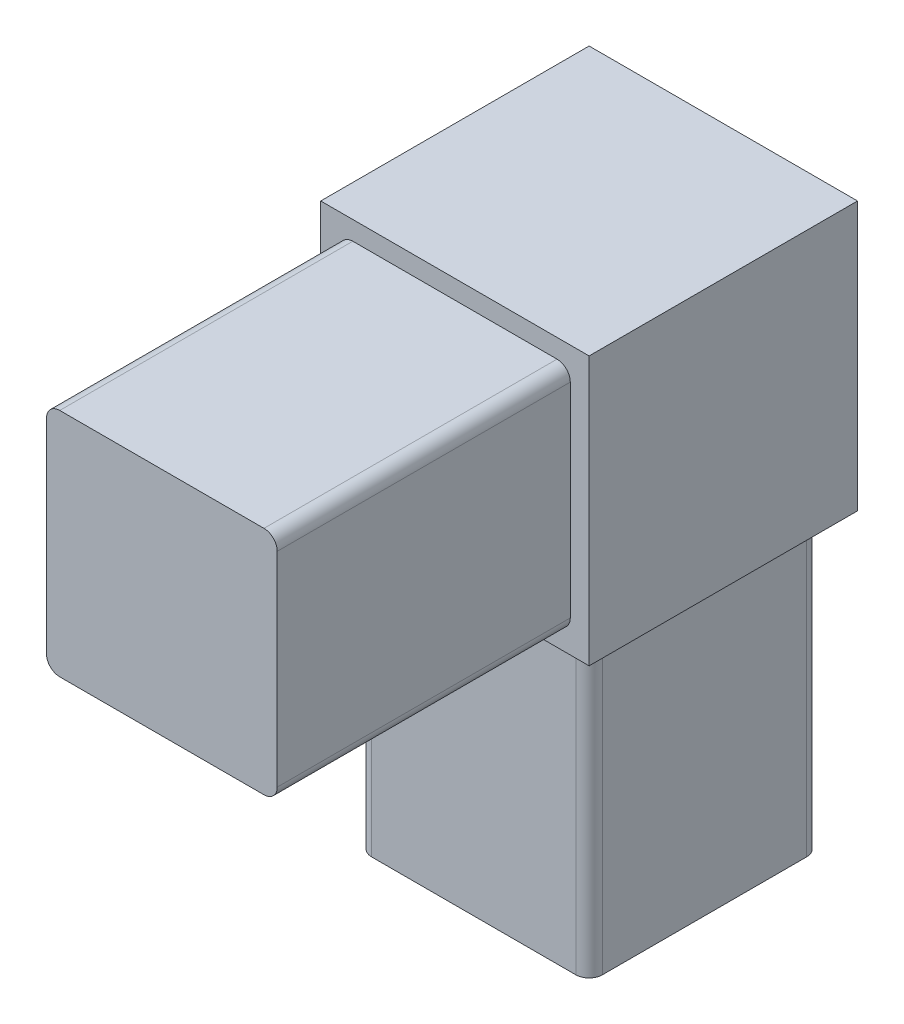
ISO-10303-21;
HEADER;
FILE_DESCRIPTION(('STEP AP214'),'2;1');
FILE_NAME('part.step','',(''),(''),'','','');
FILE_SCHEMA(('AUTOMOTIVE_DESIGN { 1 0 10303 214 1 1 1 1 }'));
ENDSEC;
DATA;
#1=APPLICATION_CONTEXT('core data for automotive mechanical design processes');
#2=APPLICATION_PROTOCOL_DEFINITION('international standard','automotive_design',2000,#1);
#3=PRODUCT_CONTEXT('',#1,'mechanical');
#4=PRODUCT('Part','Part','',(#3));
#5=PRODUCT_RELATED_PRODUCT_CATEGORY('part','',(#4));
#6=PRODUCT_DEFINITION_FORMATION('','',#4);
#7=PRODUCT_DEFINITION_CONTEXT('part definition',#1,'design');
#8=PRODUCT_DEFINITION('design','',#6,#7);
#9=PRODUCT_DEFINITION_SHAPE('','',#8);
#10=(LENGTH_UNIT() NAMED_UNIT(*) SI_UNIT(.MILLI.,.METRE.));
#11=(NAMED_UNIT(*) PLANE_ANGLE_UNIT() SI_UNIT($,.RADIAN.));
#12=(NAMED_UNIT(*) SI_UNIT($,.STERADIAN.) SOLID_ANGLE_UNIT());
#13=UNCERTAINTY_MEASURE_WITH_UNIT(LENGTH_MEASURE(1.E-05),#10,'distance_accuracy_value','');
#14=(GEOMETRIC_REPRESENTATION_CONTEXT(3) GLOBAL_UNCERTAINTY_ASSIGNED_CONTEXT((#13)) GLOBAL_UNIT_ASSIGNED_CONTEXT((#10,
#11,#12)) REPRESENTATION_CONTEXT('',''));
#15=CARTESIAN_POINT('',(0.,0.,0.));
#16=DIRECTION('',(0.,0.,1.));
#17=DIRECTION('',(1.,0.,0.));
#18=AXIS2_PLACEMENT_3D('',#15,#16,#17);
#19=CARTESIAN_POINT('',(-12.8524,53.7718,12.8524));
#20=DIRECTION('',(0.,0.,-1.));
#21=DIRECTION('',(-1.,0.,0.));
#22=AXIS2_PLACEMENT_3D('',#19,#20,#21);
#23=PLANE('',#22);
#24=DIRECTION('',(1.,0.,0.));
#25=VECTOR('',#24,1.);
#26=CARTESIAN_POINT('',(-12.8524,28.067,12.8524));
#27=LINE('',#26,#25);
#28=CARTESIAN_POINT('',(-12.8524,28.067,12.8524));
#29=VERTEX_POINT('',#28);
#30=CARTESIAN_POINT('',(12.8524,28.067,12.8524));
#31=VERTEX_POINT('',#30);
#32=EDGE_CURVE('E191',#29,#31,#27,.T.);
#33=ORIENTED_EDGE('',*,*,#32,.T.);
#34=DIRECTION('',(0.,-1.,0.));
#35=VECTOR('',#34,1.);
#36=CARTESIAN_POINT('',(12.8524,53.7718,12.8524));
#37=LINE('',#36,#35);
#38=CARTESIAN_POINT('',(12.8524,53.7718,12.8524));
#39=VERTEX_POINT('',#38);
#40=EDGE_CURVE('E411',#39,#31,#37,.T.);
#41=ORIENTED_EDGE('',*,*,#40,.F.);
#42=DIRECTION('',(1.,0.,0.));
#43=VECTOR('',#42,1.);
#44=CARTESIAN_POINT('',(-12.8524,53.7718,12.8524));
#45=LINE('',#44,#43);
#46=CARTESIAN_POINT('',(-12.8524,53.7718,12.8524));
#47=VERTEX_POINT('',#46);
#48=EDGE_CURVE('E187',#47,#39,#45,.T.);
#49=ORIENTED_EDGE('',*,*,#48,.F.);
#50=DIRECTION('',(0.,-1.,0.));
#51=VECTOR('',#50,1.);
#52=CARTESIAN_POINT('',(-12.8524,53.7718,12.8524));
#53=LINE('',#52,#51);
#54=EDGE_CURVE('E201',#47,#29,#53,.T.);
#55=ORIENTED_EDGE('',*,*,#54,.T.);
#56=EDGE_LOOP('',(#33,#41,#49,#55));
#57=FACE_BOUND('',#56,.T.);
#58=DIRECTION('',(0.,1.,0.));
#59=VECTOR('',#58,1.);
#60=CARTESIAN_POINT('',(11.049,29.8704,12.8524));
#61=LINE('',#60,#59);
#62=CARTESIAN_POINT('',(11.049,31.1404,12.8524));
#63=VERTEX_POINT('',#62);
#64=CARTESIAN_POINT('',(11.049,50.6984,12.8524));
#65=VERTEX_POINT('',#64);
#66=EDGE_CURVE('E398',#63,#65,#61,.T.);
#67=ORIENTED_EDGE('',*,*,#66,.F.);
#68=CARTESIAN_POINT('',(9.779,31.1404,12.8524));
#69=DIRECTION('',(0.,0.,-1.));
#70=DIRECTION('',(-1.,0.,0.));
#71=AXIS2_PLACEMENT_3D('',#68,#69,#70);
#72=CIRCLE('',#71,1.27);
#73=CARTESIAN_POINT('',(9.779,29.8704,12.8524));
#74=VERTEX_POINT('',#73);
#75=EDGE_CURVE('E279',#63,#74,#72,.T.);
#76=ORIENTED_EDGE('',*,*,#75,.T.);
#77=DIRECTION('',(1.,0.,0.));
#78=VECTOR('',#77,1.);
#79=CARTESIAN_POINT('',(-11.049,29.8704,12.8524));
#80=LINE('',#79,#78);
#81=CARTESIAN_POINT('',(-9.779,29.8704,12.8524));
#82=VERTEX_POINT('',#81);
#83=EDGE_CURVE('E406',#82,#74,#80,.T.);
#84=ORIENTED_EDGE('',*,*,#83,.F.);
#85=CARTESIAN_POINT('',(-9.779,31.1404,12.8524));
#86=DIRECTION('',(0.,0.,-1.));
#87=DIRECTION('',(-1.,0.,0.));
#88=AXIS2_PLACEMENT_3D('',#85,#86,#87);
#89=CIRCLE('',#88,1.27);
#90=CARTESIAN_POINT('',(-11.049,31.1404,12.8524));
#91=VERTEX_POINT('',#90);
#92=EDGE_CURVE('E283',#82,#91,#89,.T.);
#93=ORIENTED_EDGE('',*,*,#92,.T.);
#94=DIRECTION('',(0.,-1.,0.));
#95=VECTOR('',#94,1.);
#96=CARTESIAN_POINT('',(-11.049,29.8704,12.8524));
#97=LINE('',#96,#95);
#98=CARTESIAN_POINT('',(-11.049,50.6984,12.8524));
#99=VERTEX_POINT('',#98);
#100=EDGE_CURVE('E404',#99,#91,#97,.T.);
#101=ORIENTED_EDGE('',*,*,#100,.F.);
#102=CARTESIAN_POINT('',(-9.779,50.6984,12.8524));
#103=DIRECTION('',(0.,0.,-1.));
#104=DIRECTION('',(-1.,0.,0.));
#105=AXIS2_PLACEMENT_3D('',#102,#103,#104);
#106=CIRCLE('',#105,1.27);
#107=CARTESIAN_POINT('',(-9.779,51.9684,12.8524));
#108=VERTEX_POINT('',#107);
#109=EDGE_CURVE('E281',#99,#108,#106,.T.);
#110=ORIENTED_EDGE('',*,*,#109,.T.);
#111=DIRECTION('',(-1.,0.,0.));
#112=VECTOR('',#111,1.);
#113=CARTESIAN_POINT('',(-11.049,51.9684,12.8524));
#114=LINE('',#113,#112);
#115=CARTESIAN_POINT('',(9.779,51.9684,12.8524));
#116=VERTEX_POINT('',#115);
#117=EDGE_CURVE('E401',#116,#108,#114,.T.);
#118=ORIENTED_EDGE('',*,*,#117,.F.);
#119=CARTESIAN_POINT('',(9.779,50.6984,12.8524));
#120=DIRECTION('',(0.,0.,-1.));
#121=DIRECTION('',(-1.,0.,0.));
#122=AXIS2_PLACEMENT_3D('',#119,#120,#121);
#123=CIRCLE('',#122,1.27);
#124=EDGE_CURVE('E277',#116,#65,#123,.T.);
#125=ORIENTED_EDGE('',*,*,#124,.T.);
#126=EDGE_LOOP('',(#67,#76,#84,#93,#101,#110,#118,#125));
#127=FACE_BOUND('',#126,.T.);
#128=ADVANCED_FACE('F34',(#57,#127),#23,.F.);
#129=CARTESIAN_POINT('',(11.049,28.067,-11.049));
#130=DIRECTION('',(-1.,0.,0.));
#131=DIRECTION('',(0.,0.,1.));
#132=AXIS2_PLACEMENT_3D('',#129,#130,#131);
#133=PLANE('',#132);
#134=DIRECTION('',(0.,0.,-1.));
#135=VECTOR('',#134,1.);
#136=CARTESIAN_POINT('',(11.049,28.067,-11.049));
#137=LINE('',#136,#135);
#138=CARTESIAN_POINT('',(11.049,28.067,9.779));
#139=VERTEX_POINT('',#138);
#140=CARTESIAN_POINT('',(11.049,28.067,-9.779));
#141=VERTEX_POINT('',#140);
#142=EDGE_CURVE('E205',#139,#141,#137,.T.);
#143=ORIENTED_EDGE('',*,*,#142,.F.);
#144=DIRECTION('',(0.,-1.,0.));
#145=VECTOR('',#144,1.);
#146=CARTESIAN_POINT('',(11.049,28.067,9.779));
#147=LINE('',#146,#145);
#148=CARTESIAN_POINT('',(11.049,0.,9.779));
#149=VERTEX_POINT('',#148);
#150=EDGE_CURVE('E270',#139,#149,#147,.T.);
#151=ORIENTED_EDGE('',*,*,#150,.T.);
#152=DIRECTION('',(0.,0.,-1.));
#153=VECTOR('',#152,1.);
#154=CARTESIAN_POINT('',(11.049,0.,-11.049));
#155=LINE('',#154,#153);
#156=CARTESIAN_POINT('',(11.049,0.,-9.779));
#157=VERTEX_POINT('',#156);
#158=EDGE_CURVE('E196',#149,#157,#155,.T.);
#159=ORIENTED_EDGE('',*,*,#158,.T.);
#160=DIRECTION('',(0.,-1.,0.));
#161=VECTOR('',#160,1.);
#162=CARTESIAN_POINT('',(11.049,28.067,-9.779));
#163=LINE('',#162,#161);
#164=EDGE_CURVE('E268',#157,#141,#163,.F.);
#165=ORIENTED_EDGE('',*,*,#164,.T.);
#166=EDGE_LOOP('',(#143,#151,#159,#165));
#167=FACE_BOUND('',#166,.T.);
#168=ADVANCED_FACE('F310',(#167),#133,.F.);
#169=CARTESIAN_POINT('',(-11.049,28.067,-11.049));
#170=DIRECTION('',(0.,0.,1.));
#171=DIRECTION('',(1.,0.,0.));
#172=AXIS2_PLACEMENT_3D('',#169,#170,#171);
#173=PLANE('',#172);
#174=DIRECTION('',(-1.,0.,0.));
#175=VECTOR('',#174,1.);
#176=CARTESIAN_POINT('',(-11.049,0.,-11.049));
#177=LINE('',#176,#175);
#178=CARTESIAN_POINT('',(9.779,0.,-11.049));
#179=VERTEX_POINT('',#178);
#180=CARTESIAN_POINT('',(-9.779,0.,-11.049));
#181=VERTEX_POINT('',#180);
#182=EDGE_CURVE('E199',#179,#181,#177,.T.);
#183=ORIENTED_EDGE('',*,*,#182,.T.);
#184=DIRECTION('',(0.,-1.,0.));
#185=VECTOR('',#184,1.);
#186=CARTESIAN_POINT('',(-9.779,28.067,-11.049));
#187=LINE('',#186,#185);
#188=CARTESIAN_POINT('',(-9.779,28.067,-11.049));
#189=VERTEX_POINT('',#188);
#190=EDGE_CURVE('E49',#181,#189,#187,.F.);
#191=ORIENTED_EDGE('',*,*,#190,.T.);
#192=DIRECTION('',(-1.,0.,0.));
#193=VECTOR('',#192,1.);
#194=CARTESIAN_POINT('',(-11.049,28.067,-11.049));
#195=LINE('',#194,#193);
#196=CARTESIAN_POINT('',(9.779,28.067,-11.049));
#197=VERTEX_POINT('',#196);
#198=EDGE_CURVE('E207',#197,#189,#195,.T.);
#199=ORIENTED_EDGE('',*,*,#198,.F.);
#200=DIRECTION('',(0.,-1.,0.));
#201=VECTOR('',#200,1.);
#202=CARTESIAN_POINT('',(9.779,28.067,-11.049));
#203=LINE('',#202,#201);
#204=EDGE_CURVE('E273',#197,#179,#203,.T.);
#205=ORIENTED_EDGE('',*,*,#204,.T.);
#206=EDGE_LOOP('',(#183,#191,#199,#205));
#207=FACE_BOUND('',#206,.T.);
#208=ADVANCED_FACE('F303',(#207),#173,.F.);
#209=CARTESIAN_POINT('',(-11.049,28.067,-11.049));
#210=DIRECTION('',(1.,0.,0.));
#211=DIRECTION('',(0.,0.,-1.));
#212=AXIS2_PLACEMENT_3D('',#209,#210,#211);
#213=PLANE('',#212);
#214=DIRECTION('',(0.,0.,1.));
#215=VECTOR('',#214,1.);
#216=CARTESIAN_POINT('',(-11.049,0.,-11.049));
#217=LINE('',#216,#215);
#218=CARTESIAN_POINT('',(-11.049,0.,-9.779));
#219=VERTEX_POINT('',#218);
#220=CARTESIAN_POINT('',(-11.049,0.,9.779));
#221=VERTEX_POINT('',#220);
#222=EDGE_CURVE('E218',#219,#221,#217,.T.);
#223=ORIENTED_EDGE('',*,*,#222,.T.);
#224=DIRECTION('',(0.,-1.,0.));
#225=VECTOR('',#224,1.);
#226=CARTESIAN_POINT('',(-11.049,28.067,9.779));
#227=LINE('',#226,#225);
#228=CARTESIAN_POINT('',(-11.049,28.067,9.779));
#229=VERTEX_POINT('',#228);
#230=EDGE_CURVE('E266',#221,#229,#227,.F.);
#231=ORIENTED_EDGE('',*,*,#230,.T.);
#232=DIRECTION('',(0.,0.,1.));
#233=VECTOR('',#232,1.);
#234=CARTESIAN_POINT('',(-11.049,28.067,-11.049));
#235=LINE('',#234,#233);
#236=CARTESIAN_POINT('',(-11.049,28.067,-9.779));
#237=VERTEX_POINT('',#236);
#238=EDGE_CURVE('E210',#237,#229,#235,.T.);
#239=ORIENTED_EDGE('',*,*,#238,.F.);
#240=DIRECTION('',(0.,-1.,0.));
#241=VECTOR('',#240,1.);
#242=CARTESIAN_POINT('',(-11.049,28.067,-9.779));
#243=LINE('',#242,#241);
#244=EDGE_CURVE('E263',#237,#219,#243,.T.);
#245=ORIENTED_EDGE('',*,*,#244,.T.);
#246=EDGE_LOOP('',(#223,#231,#239,#245));
#247=FACE_BOUND('',#246,.T.);
#248=ADVANCED_FACE('F295',(#247),#213,.F.);
#249=CARTESIAN_POINT('',(-11.049,28.067,11.049));
#250=DIRECTION('',(0.,0.,-1.));
#251=DIRECTION('',(-1.,0.,0.));
#252=AXIS2_PLACEMENT_3D('',#249,#250,#251);
#253=PLANE('',#252);
#254=DIRECTION('',(1.,0.,0.));
#255=VECTOR('',#254,1.);
#256=CARTESIAN_POINT('',(-11.049,28.067,11.049));
#257=LINE('',#256,#255);
#258=CARTESIAN_POINT('',(-9.779,28.067,11.049));
#259=VERTEX_POINT('',#258);
#260=CARTESIAN_POINT('',(9.779,28.067,11.049));
#261=VERTEX_POINT('',#260);
#262=EDGE_CURVE('E213',#259,#261,#257,.T.);
#263=ORIENTED_EDGE('',*,*,#262,.F.);
#264=DIRECTION('',(0.,-1.,0.));
#265=VECTOR('',#264,1.);
#266=CARTESIAN_POINT('',(-9.779,28.067,11.049));
#267=LINE('',#266,#265);
#268=CARTESIAN_POINT('',(-9.779,0.,11.049));
#269=VERTEX_POINT('',#268);
#270=EDGE_CURVE('E252',#259,#269,#267,.T.);
#271=ORIENTED_EDGE('',*,*,#270,.T.);
#272=DIRECTION('',(1.,0.,0.));
#273=VECTOR('',#272,1.);
#274=CARTESIAN_POINT('',(-11.049,0.,11.049));
#275=LINE('',#274,#273);
#276=CARTESIAN_POINT('',(9.779,0.,11.049));
#277=VERTEX_POINT('',#276);
#278=EDGE_CURVE('E208',#269,#277,#275,.T.);
#279=ORIENTED_EDGE('',*,*,#278,.T.);
#280=DIRECTION('',(0.,-1.,0.));
#281=VECTOR('',#280,1.);
#282=CARTESIAN_POINT('',(9.779,28.067,11.049));
#283=LINE('',#282,#281);
#284=EDGE_CURVE('E250',#277,#261,#283,.F.);
#285=ORIENTED_EDGE('',*,*,#284,.T.);
#286=EDGE_LOOP('',(#263,#271,#279,#285));
#287=FACE_BOUND('',#286,.T.);
#288=ADVANCED_FACE('F318',(#287),#253,.F.);
#289=CARTESIAN_POINT('',(0.,0.,0.));
#290=DIRECTION('',(0.,1.,0.));
#291=DIRECTION('',(0.,0.,1.));
#292=AXIS2_PLACEMENT_3D('',#289,#290,#291);
#293=PLANE('',#292);
#294=ORIENTED_EDGE('',*,*,#278,.F.);
#295=CARTESIAN_POINT('',(-9.779,0.,9.779));
#296=DIRECTION('',(0.,1.,0.));
#297=DIRECTION('',(0.,0.,1.));
#298=AXIS2_PLACEMENT_3D('',#295,#296,#297);
#299=CIRCLE('',#298,1.27);
#300=EDGE_CURVE('E261',#269,#221,#299,.F.);
#301=ORIENTED_EDGE('',*,*,#300,.T.);
#302=ORIENTED_EDGE('',*,*,#222,.F.);
#303=CARTESIAN_POINT('',(-9.779,0.,-9.779));
#304=DIRECTION('',(0.,1.,0.));
#305=DIRECTION('',(0.,0.,1.));
#306=AXIS2_PLACEMENT_3D('',#303,#304,#305);
#307=CIRCLE('',#306,1.27);
#308=EDGE_CURVE('E257',#219,#181,#307,.F.);
#309=ORIENTED_EDGE('',*,*,#308,.T.);
#310=ORIENTED_EDGE('',*,*,#182,.F.);
#311=CARTESIAN_POINT('',(9.779,0.,-9.779));
#312=DIRECTION('',(0.,1.,0.));
#313=DIRECTION('',(0.,0.,1.));
#314=AXIS2_PLACEMENT_3D('',#311,#312,#313);
#315=CIRCLE('',#314,1.27);
#316=EDGE_CURVE('E255',#179,#157,#315,.F.);
#317=ORIENTED_EDGE('',*,*,#316,.T.);
#318=ORIENTED_EDGE('',*,*,#158,.F.);
#319=CARTESIAN_POINT('',(9.779,0.,9.779));
#320=DIRECTION('',(0.,1.,0.));
#321=DIRECTION('',(0.,0.,1.));
#322=AXIS2_PLACEMENT_3D('',#319,#320,#321);
#323=CIRCLE('',#322,1.27);
#324=EDGE_CURVE('E259',#149,#277,#323,.F.);
#325=ORIENTED_EDGE('',*,*,#324,.T.);
#326=EDGE_LOOP('',(#294,#301,#302,#309,#310,#317,#318,#325));
#327=FACE_BOUND('',#326,.T.);
#328=ADVANCED_FACE('F302',(#327),#293,.F.);
#329=CARTESIAN_POINT('',(0.,28.067,0.));
#330=DIRECTION('',(0.,-1.,0.));
#331=DIRECTION('',(0.,0.,-1.));
#332=AXIS2_PLACEMENT_3D('',#329,#330,#331);
#333=PLANE('',#332);
#334=DIRECTION('',(0.,0.,-1.));
#335=VECTOR('',#334,1.);
#336=CARTESIAN_POINT('',(12.8524,28.067,12.8524));
#337=LINE('',#336,#335);
#338=CARTESIAN_POINT('',(12.8524,28.067,-12.8524));
#339=VERTEX_POINT('',#338);
#340=EDGE_CURVE('E195',#31,#339,#337,.T.);
#341=ORIENTED_EDGE('',*,*,#340,.F.);
#342=ORIENTED_EDGE('',*,*,#32,.F.);
#343=DIRECTION('',(0.,0.,1.));
#344=VECTOR('',#343,1.);
#345=CARTESIAN_POINT('',(-12.8524,28.067,12.8524));
#346=LINE('',#345,#344);
#347=CARTESIAN_POINT('',(-12.8524,28.067,-12.8524));
#348=VERTEX_POINT('',#347);
#349=EDGE_CURVE('E415',#348,#29,#346,.T.);
#350=ORIENTED_EDGE('',*,*,#349,.F.);
#351=DIRECTION('',(-1.,0.,0.));
#352=VECTOR('',#351,1.);
#353=CARTESIAN_POINT('',(-12.8524,28.067,-12.8524));
#354=LINE('',#353,#352);
#355=EDGE_CURVE('E413',#339,#348,#354,.T.);
#356=ORIENTED_EDGE('',*,*,#355,.F.);
#357=EDGE_LOOP('',(#341,#342,#350,#356));
#358=FACE_BOUND('',#357,.T.);
#359=ORIENTED_EDGE('',*,*,#262,.T.);
#360=CARTESIAN_POINT('',(9.779,28.067,9.779));
#361=DIRECTION('',(0.,-1.,0.));
#362=DIRECTION('',(0.,0.,-1.));
#363=AXIS2_PLACEMENT_3D('',#360,#361,#362);
#364=CIRCLE('',#363,1.27);
#365=EDGE_CURVE('E287',#261,#139,#364,.F.);
#366=ORIENTED_EDGE('',*,*,#365,.T.);
#367=ORIENTED_EDGE('',*,*,#142,.T.);
#368=CARTESIAN_POINT('',(9.779,28.067,-9.779));
#369=DIRECTION('',(0.,-1.,0.));
#370=DIRECTION('',(0.,0.,-1.));
#371=AXIS2_PLACEMENT_3D('',#368,#369,#370);
#372=CIRCLE('',#371,1.27);
#373=EDGE_CURVE('E11',#141,#197,#372,.F.);
#374=ORIENTED_EDGE('',*,*,#373,.T.);
#375=ORIENTED_EDGE('',*,*,#198,.T.);
#376=CARTESIAN_POINT('',(-9.779,28.067,-9.779));
#377=DIRECTION('',(0.,-1.,0.));
#378=DIRECTION('',(0.,0.,-1.));
#379=AXIS2_PLACEMENT_3D('',#376,#377,#378);
#380=CIRCLE('',#379,1.27);
#381=EDGE_CURVE('E42',#189,#237,#380,.F.);
#382=ORIENTED_EDGE('',*,*,#381,.T.);
#383=ORIENTED_EDGE('',*,*,#238,.T.);
#384=CARTESIAN_POINT('',(-9.779,28.067,9.779));
#385=DIRECTION('',(0.,-1.,0.));
#386=DIRECTION('',(0.,0.,-1.));
#387=AXIS2_PLACEMENT_3D('',#384,#385,#386);
#388=CIRCLE('',#387,1.27);
#389=EDGE_CURVE('E285',#229,#259,#388,.F.);
#390=ORIENTED_EDGE('',*,*,#389,.T.);
#391=EDGE_LOOP('',(#359,#366,#367,#374,#375,#382,#383,#390));
#392=FACE_BOUND('',#391,.T.);
#393=ADVANCED_FACE('F290',(#358,#392),#333,.T.);
#394=CARTESIAN_POINT('',(12.8524,53.7718,12.8524));
#395=DIRECTION('',(-1.,0.,0.));
#396=DIRECTION('',(0.,0.,1.));
#397=AXIS2_PLACEMENT_3D('',#394,#395,#396);
#398=PLANE('',#397);
#399=ORIENTED_EDGE('',*,*,#340,.T.);
#400=DIRECTION('',(0.,-1.,0.));
#401=VECTOR('',#400,1.);
#402=CARTESIAN_POINT('',(12.8524,53.7718,-12.8524));
#403=LINE('',#402,#401);
#404=CARTESIAN_POINT('',(12.8524,53.7718,-12.8524));
#405=VERTEX_POINT('',#404);
#406=EDGE_CURVE('E175',#405,#339,#403,.T.);
#407=ORIENTED_EDGE('',*,*,#406,.F.);
#408=DIRECTION('',(0.,0.,-1.));
#409=VECTOR('',#408,1.);
#410=CARTESIAN_POINT('',(12.8524,53.7718,12.8524));
#411=LINE('',#410,#409);
#412=EDGE_CURVE('E182',#39,#405,#411,.T.);
#413=ORIENTED_EDGE('',*,*,#412,.F.);
#414=ORIENTED_EDGE('',*,*,#40,.T.);
#415=EDGE_LOOP('',(#399,#407,#413,#414));
#416=FACE_BOUND('',#415,.T.);
#417=ADVANCED_FACE('F193',(#416),#398,.F.);
#418=CARTESIAN_POINT('',(-12.8524,53.7718,-12.8524));
#419=DIRECTION('',(0.,0.,1.));
#420=DIRECTION('',(1.,0.,0.));
#421=AXIS2_PLACEMENT_3D('',#418,#419,#420);
#422=PLANE('',#421);
#423=ORIENTED_EDGE('',*,*,#355,.T.);
#424=DIRECTION('',(0.,-1.,0.));
#425=VECTOR('',#424,1.);
#426=CARTESIAN_POINT('',(-12.8524,53.7718,-12.8524));
#427=LINE('',#426,#425);
#428=CARTESIAN_POINT('',(-12.8524,53.7718,-12.8524));
#429=VERTEX_POINT('',#428);
#430=EDGE_CURVE('E178',#429,#348,#427,.T.);
#431=ORIENTED_EDGE('',*,*,#430,.F.);
#432=DIRECTION('',(-1.,0.,0.));
#433=VECTOR('',#432,1.);
#434=CARTESIAN_POINT('',(-12.8524,53.7718,-12.8524));
#435=LINE('',#434,#433);
#436=EDGE_CURVE('E171',#405,#429,#435,.T.);
#437=ORIENTED_EDGE('',*,*,#436,.F.);
#438=ORIENTED_EDGE('',*,*,#406,.T.);
#439=EDGE_LOOP('',(#423,#431,#437,#438));
#440=FACE_BOUND('',#439,.T.);
#441=ADVANCED_FACE('F173',(#440),#422,.F.);
#442=CARTESIAN_POINT('',(-12.8524,53.7718,12.8524));
#443=DIRECTION('',(1.,0.,0.));
#444=DIRECTION('',(0.,0.,-1.));
#445=AXIS2_PLACEMENT_3D('',#442,#443,#444);
#446=PLANE('',#445);
#447=ORIENTED_EDGE('',*,*,#349,.T.);
#448=ORIENTED_EDGE('',*,*,#54,.F.);
#449=DIRECTION('',(0.,0.,1.));
#450=VECTOR('',#449,1.);
#451=CARTESIAN_POINT('',(-12.8524,53.7718,12.8524));
#452=LINE('',#451,#450);
#453=EDGE_CURVE('E181',#429,#47,#452,.T.);
#454=ORIENTED_EDGE('',*,*,#453,.F.);
#455=ORIENTED_EDGE('',*,*,#430,.T.);
#456=EDGE_LOOP('',(#447,#448,#454,#455));
#457=FACE_BOUND('',#456,.T.);
#458=ADVANCED_FACE('F344',(#457),#446,.F.);
#459=CARTESIAN_POINT('',(0.,53.7718,0.));
#460=DIRECTION('',(0.,-1.,0.));
#461=DIRECTION('',(0.,0.,-1.));
#462=AXIS2_PLACEMENT_3D('',#459,#460,#461);
#463=PLANE('',#462);
#464=ORIENTED_EDGE('',*,*,#412,.T.);
#465=ORIENTED_EDGE('',*,*,#436,.T.);
#466=ORIENTED_EDGE('',*,*,#453,.T.);
#467=ORIENTED_EDGE('',*,*,#48,.T.);
#468=EDGE_LOOP('',(#464,#465,#466,#467));
#469=FACE_BOUND('',#468,.T.);
#470=ADVANCED_FACE('F185',(#469),#463,.F.);
#471=CARTESIAN_POINT('',(11.049,29.8704,40.9194));
#472=DIRECTION('',(-1.,0.,0.));
#473=DIRECTION('',(0.,0.,1.));
#474=AXIS2_PLACEMENT_3D('',#471,#472,#473);
#475=PLANE('',#474);
#476=ORIENTED_EDGE('',*,*,#66,.T.);
#477=DIRECTION('',(0.,0.,-1.));
#478=VECTOR('',#477,1.);
#479=CARTESIAN_POINT('',(11.049,50.6984,40.9194));
#480=LINE('',#479,#478);
#481=CARTESIAN_POINT('',(11.049,50.6984,40.9194));
#482=VERTEX_POINT('',#481);
#483=EDGE_CURVE('E230',#65,#482,#480,.F.);
#484=ORIENTED_EDGE('',*,*,#483,.T.);
#485=DIRECTION('',(0.,1.,0.));
#486=VECTOR('',#485,1.);
#487=CARTESIAN_POINT('',(11.049,29.8704,40.9194));
#488=LINE('',#487,#486);
#489=CARTESIAN_POINT('',(11.049,31.1404,40.9194));
#490=VERTEX_POINT('',#489);
#491=EDGE_CURVE('E394',#490,#482,#488,.T.);
#492=ORIENTED_EDGE('',*,*,#491,.F.);
#493=DIRECTION('',(0.,0.,-1.));
#494=VECTOR('',#493,1.);
#495=CARTESIAN_POINT('',(11.049,31.1404,40.9194));
#496=LINE('',#495,#494);
#497=EDGE_CURVE('E227',#490,#63,#496,.T.);
#498=ORIENTED_EDGE('',*,*,#497,.T.);
#499=EDGE_LOOP('',(#476,#484,#492,#498));
#500=FACE_BOUND('',#499,.T.);
#501=ADVANCED_FACE('F448',(#500),#475,.F.);
#502=CARTESIAN_POINT('',(-11.049,51.9684,40.9194));
#503=DIRECTION('',(0.,-1.,0.));
#504=DIRECTION('',(0.,0.,-1.));
#505=AXIS2_PLACEMENT_3D('',#502,#503,#504);
#506=PLANE('',#505);
#507=DIRECTION('',(-1.,0.,0.));
#508=VECTOR('',#507,1.);
#509=CARTESIAN_POINT('',(-11.049,51.9684,40.9194));
#510=LINE('',#509,#508);
#511=CARTESIAN_POINT('',(9.779,51.9684,40.9194));
#512=VERTEX_POINT('',#511);
#513=CARTESIAN_POINT('',(-9.779,51.9684,40.9194));
#514=VERTEX_POINT('',#513);
#515=EDGE_CURVE('E384',#512,#514,#510,.T.);
#516=ORIENTED_EDGE('',*,*,#515,.F.);
#517=DIRECTION('',(0.,0.,-1.));
#518=VECTOR('',#517,1.);
#519=CARTESIAN_POINT('',(9.779,51.9684,40.9194));
#520=LINE('',#519,#518);
#521=EDGE_CURVE('E224',#512,#116,#520,.T.);
#522=ORIENTED_EDGE('',*,*,#521,.T.);
#523=ORIENTED_EDGE('',*,*,#117,.T.);
#524=DIRECTION('',(0.,0.,-1.));
#525=VECTOR('',#524,1.);
#526=CARTESIAN_POINT('',(-9.779,51.9684,40.9194));
#527=LINE('',#526,#525);
#528=EDGE_CURVE('E215',#108,#514,#527,.F.);
#529=ORIENTED_EDGE('',*,*,#528,.T.);
#530=EDGE_LOOP('',(#516,#522,#523,#529));
#531=FACE_BOUND('',#530,.T.);
#532=ADVANCED_FACE('F455',(#531),#506,.F.);
#533=CARTESIAN_POINT('',(-11.049,29.8704,40.9194));
#534=DIRECTION('',(1.,0.,0.));
#535=DIRECTION('',(0.,0.,-1.));
#536=AXIS2_PLACEMENT_3D('',#533,#534,#535);
#537=PLANE('',#536);
#538=DIRECTION('',(0.,-1.,0.));
#539=VECTOR('',#538,1.);
#540=CARTESIAN_POINT('',(-11.049,29.8704,40.9194));
#541=LINE('',#540,#539);
#542=CARTESIAN_POINT('',(-11.049,50.6984,40.9194));
#543=VERTEX_POINT('',#542);
#544=CARTESIAN_POINT('',(-11.049,31.1404,40.9194));
#545=VERTEX_POINT('',#544);
#546=EDGE_CURVE('E381',#543,#545,#541,.T.);
#547=ORIENTED_EDGE('',*,*,#546,.F.);
#548=DIRECTION('',(0.,0.,-1.));
#549=VECTOR('',#548,1.);
#550=CARTESIAN_POINT('',(-11.049,50.6984,40.9194));
#551=LINE('',#550,#549);
#552=EDGE_CURVE('E247',#543,#99,#551,.T.);
#553=ORIENTED_EDGE('',*,*,#552,.T.);
#554=ORIENTED_EDGE('',*,*,#100,.T.);
#555=DIRECTION('',(0.,0.,-1.));
#556=VECTOR('',#555,1.);
#557=CARTESIAN_POINT('',(-11.049,31.1404,40.9194));
#558=LINE('',#557,#556);
#559=EDGE_CURVE('E245',#91,#545,#558,.F.);
#560=ORIENTED_EDGE('',*,*,#559,.T.);
#561=EDGE_LOOP('',(#547,#553,#554,#560));
#562=FACE_BOUND('',#561,.T.);
#563=ADVANCED_FACE('F386',(#562),#537,.F.);
#564=CARTESIAN_POINT('',(-11.049,29.8704,40.9194));
#565=DIRECTION('',(0.,1.,0.));
#566=DIRECTION('',(0.,0.,1.));
#567=AXIS2_PLACEMENT_3D('',#564,#565,#566);
#568=PLANE('',#567);
#569=ORIENTED_EDGE('',*,*,#83,.T.);
#570=DIRECTION('',(0.,0.,-1.));
#571=VECTOR('',#570,1.);
#572=CARTESIAN_POINT('',(9.779,29.8704,40.9194));
#573=LINE('',#572,#571);
#574=CARTESIAN_POINT('',(9.779,29.8704,40.9194));
#575=VERTEX_POINT('',#574);
#576=EDGE_CURVE('E243',#74,#575,#573,.F.);
#577=ORIENTED_EDGE('',*,*,#576,.T.);
#578=DIRECTION('',(1.,0.,0.));
#579=VECTOR('',#578,1.);
#580=CARTESIAN_POINT('',(-11.049,29.8704,40.9194));
#581=LINE('',#580,#579);
#582=CARTESIAN_POINT('',(-9.779,29.8704,40.9194));
#583=VERTEX_POINT('',#582);
#584=EDGE_CURVE('E390',#583,#575,#581,.T.);
#585=ORIENTED_EDGE('',*,*,#584,.F.);
#586=DIRECTION('',(0.,0.,-1.));
#587=VECTOR('',#586,1.);
#588=CARTESIAN_POINT('',(-9.779,29.8704,40.9194));
#589=LINE('',#588,#587);
#590=EDGE_CURVE('E240',#583,#82,#589,.T.);
#591=ORIENTED_EDGE('',*,*,#590,.T.);
#592=EDGE_LOOP('',(#569,#577,#585,#591));
#593=FACE_BOUND('',#592,.T.);
#594=ADVANCED_FACE('F470',(#593),#568,.F.);
#595=CARTESIAN_POINT('',(0.,0.,40.9194));
#596=DIRECTION('',(0.,0.,-1.));
#597=DIRECTION('',(-1.,0.,0.));
#598=AXIS2_PLACEMENT_3D('',#595,#596,#597);
#599=PLANE('',#598);
#600=ORIENTED_EDGE('',*,*,#491,.T.);
#601=CARTESIAN_POINT('',(9.779,50.6984,40.9194));
#602=DIRECTION('',(0.,0.,-1.));
#603=DIRECTION('',(-1.,0.,0.));
#604=AXIS2_PLACEMENT_3D('',#601,#602,#603);
#605=CIRCLE('',#604,1.27);
#606=EDGE_CURVE('E238',#482,#512,#605,.F.);
#607=ORIENTED_EDGE('',*,*,#606,.T.);
#608=ORIENTED_EDGE('',*,*,#515,.T.);
#609=CARTESIAN_POINT('',(-9.779,50.6984,40.9194));
#610=DIRECTION('',(0.,0.,-1.));
#611=DIRECTION('',(-1.,0.,0.));
#612=AXIS2_PLACEMENT_3D('',#609,#610,#611);
#613=CIRCLE('',#612,1.27);
#614=EDGE_CURVE('E234',#514,#543,#613,.F.);
#615=ORIENTED_EDGE('',*,*,#614,.T.);
#616=ORIENTED_EDGE('',*,*,#546,.T.);
#617=CARTESIAN_POINT('',(-9.779,31.1404,40.9194));
#618=DIRECTION('',(0.,0.,-1.));
#619=DIRECTION('',(-1.,0.,0.));
#620=AXIS2_PLACEMENT_3D('',#617,#618,#619);
#621=CIRCLE('',#620,1.27);
#622=EDGE_CURVE('E232',#545,#583,#621,.F.);
#623=ORIENTED_EDGE('',*,*,#622,.T.);
#624=ORIENTED_EDGE('',*,*,#584,.T.);
#625=CARTESIAN_POINT('',(9.779,31.1404,40.9194));
#626=DIRECTION('',(0.,0.,-1.));
#627=DIRECTION('',(-1.,0.,0.));
#628=AXIS2_PLACEMENT_3D('',#625,#626,#627);
#629=CIRCLE('',#628,1.27);
#630=EDGE_CURVE('E236',#575,#490,#629,.F.);
#631=ORIENTED_EDGE('',*,*,#630,.T.);
#632=EDGE_LOOP('',(#600,#607,#608,#615,#616,#623,#624,#631));
#633=FACE_BOUND('',#632,.T.);
#634=ADVANCED_FACE('F364',(#633),#599,.F.);
#635=CARTESIAN_POINT('',(9.779,50.6984,40.9194));
#636=DIRECTION('',(0.,0.,-1.));
#637=DIRECTION('',(-1.,0.,0.));
#638=AXIS2_PLACEMENT_3D('',#635,#636,#637);
#639=CYLINDRICAL_SURFACE('',#638,1.27);
#640=ORIENTED_EDGE('',*,*,#606,.F.);
#641=ORIENTED_EDGE('',*,*,#483,.F.);
#642=ORIENTED_EDGE('',*,*,#124,.F.);
#643=ORIENTED_EDGE('',*,*,#521,.F.);
#644=EDGE_LOOP('',(#640,#641,#642,#643));
#645=FACE_BOUND('',#644,.T.);
#646=ADVANCED_FACE('F360',(#645),#639,.T.);
#647=CARTESIAN_POINT('',(9.779,31.1404,40.9194));
#648=DIRECTION('',(0.,0.,-1.));
#649=DIRECTION('',(-1.,0.,0.));
#650=AXIS2_PLACEMENT_3D('',#647,#648,#649);
#651=CYLINDRICAL_SURFACE('',#650,1.27);
#652=ORIENTED_EDGE('',*,*,#630,.F.);
#653=ORIENTED_EDGE('',*,*,#576,.F.);
#654=ORIENTED_EDGE('',*,*,#75,.F.);
#655=ORIENTED_EDGE('',*,*,#497,.F.);
#656=EDGE_LOOP('',(#652,#653,#654,#655));
#657=FACE_BOUND('',#656,.T.);
#658=ADVANCED_FACE('F363',(#657),#651,.T.);
#659=CARTESIAN_POINT('',(-9.779,50.6984,40.9194));
#660=DIRECTION('',(0.,0.,-1.));
#661=DIRECTION('',(-1.,0.,0.));
#662=AXIS2_PLACEMENT_3D('',#659,#660,#661);
#663=CYLINDRICAL_SURFACE('',#662,1.27);
#664=ORIENTED_EDGE('',*,*,#614,.F.);
#665=ORIENTED_EDGE('',*,*,#528,.F.);
#666=ORIENTED_EDGE('',*,*,#109,.F.);
#667=ORIENTED_EDGE('',*,*,#552,.F.);
#668=EDGE_LOOP('',(#664,#665,#666,#667));
#669=FACE_BOUND('',#668,.T.);
#670=ADVANCED_FACE('F330',(#669),#663,.T.);
#671=CARTESIAN_POINT('',(-9.779,31.1404,40.9194));
#672=DIRECTION('',(0.,0.,-1.));
#673=DIRECTION('',(-1.,0.,0.));
#674=AXIS2_PLACEMENT_3D('',#671,#672,#673);
#675=CYLINDRICAL_SURFACE('',#674,1.27);
#676=ORIENTED_EDGE('',*,*,#622,.F.);
#677=ORIENTED_EDGE('',*,*,#559,.F.);
#678=ORIENTED_EDGE('',*,*,#92,.F.);
#679=ORIENTED_EDGE('',*,*,#590,.F.);
#680=EDGE_LOOP('',(#676,#677,#678,#679));
#681=FACE_BOUND('',#680,.T.);
#682=ADVANCED_FACE('F323',(#681),#675,.T.);
#683=CARTESIAN_POINT('',(-9.779,28.067,9.779));
#684=DIRECTION('',(0.,-1.,0.));
#685=DIRECTION('',(0.,0.,-1.));
#686=AXIS2_PLACEMENT_3D('',#683,#684,#685);
#687=CYLINDRICAL_SURFACE('',#686,1.27);
#688=ORIENTED_EDGE('',*,*,#389,.F.);
#689=ORIENTED_EDGE('',*,*,#230,.F.);
#690=ORIENTED_EDGE('',*,*,#300,.F.);
#691=ORIENTED_EDGE('',*,*,#270,.F.);
#692=EDGE_LOOP('',(#688,#689,#690,#691));
#693=FACE_BOUND('',#692,.T.);
#694=ADVANCED_FACE('F321',(#693),#687,.T.);
#695=CARTESIAN_POINT('',(9.779,28.067,9.779));
#696=DIRECTION('',(0.,-1.,0.));
#697=DIRECTION('',(0.,0.,-1.));
#698=AXIS2_PLACEMENT_3D('',#695,#696,#697);
#699=CYLINDRICAL_SURFACE('',#698,1.27);
#700=ORIENTED_EDGE('',*,*,#365,.F.);
#701=ORIENTED_EDGE('',*,*,#284,.F.);
#702=ORIENTED_EDGE('',*,*,#324,.F.);
#703=ORIENTED_EDGE('',*,*,#150,.F.);
#704=EDGE_LOOP('',(#700,#701,#702,#703));
#705=FACE_BOUND('',#704,.T.);
#706=ADVANCED_FACE('F314',(#705),#699,.T.);
#707=CARTESIAN_POINT('',(-9.779,28.067,-9.779));
#708=DIRECTION('',(0.,-1.,0.));
#709=DIRECTION('',(0.,0.,-1.));
#710=AXIS2_PLACEMENT_3D('',#707,#708,#709);
#711=CYLINDRICAL_SURFACE('',#710,1.27);
#712=ORIENTED_EDGE('',*,*,#381,.F.);
#713=ORIENTED_EDGE('',*,*,#190,.F.);
#714=ORIENTED_EDGE('',*,*,#308,.F.);
#715=ORIENTED_EDGE('',*,*,#244,.F.);
#716=EDGE_LOOP('',(#712,#713,#714,#715));
#717=FACE_BOUND('',#716,.T.);
#718=ADVANCED_FACE('F298',(#717),#711,.T.);
#719=CARTESIAN_POINT('',(9.779,28.067,-9.779));
#720=DIRECTION('',(0.,-1.,0.));
#721=DIRECTION('',(0.,0.,-1.));
#722=AXIS2_PLACEMENT_3D('',#719,#720,#721);
#723=CYLINDRICAL_SURFACE('',#722,1.27);
#724=ORIENTED_EDGE('',*,*,#373,.F.);
#725=ORIENTED_EDGE('',*,*,#164,.F.);
#726=ORIENTED_EDGE('',*,*,#316,.F.);
#727=ORIENTED_EDGE('',*,*,#204,.F.);
#728=EDGE_LOOP('',(#724,#725,#726,#727));
#729=FACE_BOUND('',#728,.T.);
#730=ADVANCED_FACE('F36',(#729),#723,.T.);
#731=CLOSED_SHELL('',(#128,#168,#208,#248,#288,#328,#393,#417,#441,#458,#470,#501,#532,#563,
#594,#634,#646,#658,#670,#682,#694,#706,#718,#730));
#732=MANIFOLD_SOLID_BREP('B2',#731);
#733=ADVANCED_BREP_SHAPE_REPRESENTATION('',(#18,#732),#14);
#734=SHAPE_DEFINITION_REPRESENTATION(#9,#733);
ENDSEC;
END-ISO-10303-21;
